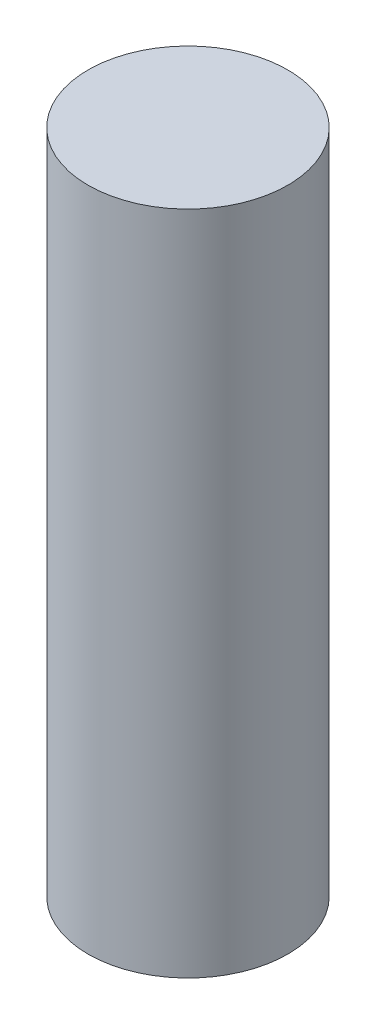
ISO-10303-21;
HEADER;
FILE_DESCRIPTION(('STEP AP214'),'2;1');
FILE_NAME('part.step','',(''),(''),'','','');
FILE_SCHEMA(('AUTOMOTIVE_DESIGN { 1 0 10303 214 1 1 1 1 }'));
ENDSEC;
DATA;
#1=APPLICATION_CONTEXT('core data for automotive mechanical design processes');
#2=APPLICATION_PROTOCOL_DEFINITION('international standard','automotive_design',2000,#1);
#3=PRODUCT_CONTEXT('',#1,'mechanical');
#4=PRODUCT('Part','Part','',(#3));
#5=PRODUCT_RELATED_PRODUCT_CATEGORY('part','',(#4));
#6=PRODUCT_DEFINITION_FORMATION('','',#4);
#7=PRODUCT_DEFINITION_CONTEXT('part definition',#1,'design');
#8=PRODUCT_DEFINITION('design','',#6,#7);
#9=PRODUCT_DEFINITION_SHAPE('','',#8);
#10=(LENGTH_UNIT() NAMED_UNIT(*) SI_UNIT(.MILLI.,.METRE.));
#11=(NAMED_UNIT(*) PLANE_ANGLE_UNIT() SI_UNIT($,.RADIAN.));
#12=(NAMED_UNIT(*) SI_UNIT($,.STERADIAN.) SOLID_ANGLE_UNIT());
#13=UNCERTAINTY_MEASURE_WITH_UNIT(LENGTH_MEASURE(1.E-05),#10,'distance_accuracy_value','');
#14=(GEOMETRIC_REPRESENTATION_CONTEXT(3) GLOBAL_UNCERTAINTY_ASSIGNED_CONTEXT((#13)) GLOBAL_UNIT_ASSIGNED_CONTEXT((#10,
#11,#12)) REPRESENTATION_CONTEXT('',''));
#15=CARTESIAN_POINT('',(0.,0.,0.));
#16=DIRECTION('',(0.,0.,1.));
#17=DIRECTION('',(1.,0.,0.));
#18=AXIS2_PLACEMENT_3D('',#15,#16,#17);
#19=CARTESIAN_POINT('',(0.,50.,0.));
#20=DIRECTION('',(0.,-1.,0.));
#21=DIRECTION('',(0.,0.,-1.));
#22=AXIS2_PLACEMENT_3D('',#19,#20,#21);
#23=CYLINDRICAL_SURFACE('',#22,7.5);
#24=CARTESIAN_POINT('',(0.,50.,0.));
#25=DIRECTION('',(0.,1.,0.));
#26=DIRECTION('',(0.,0.,1.));
#27=AXIS2_PLACEMENT_3D('',#24,#25,#26);
#28=CIRCLE('',#27,7.5);
#29=CARTESIAN_POINT('',(0.,50.,7.5));
#30=VERTEX_POINT('',#29);
#31=EDGE_CURVE('E10',#30,#30,#28,.T.);
#32=ORIENTED_EDGE('',*,*,#31,.F.);
#33=EDGE_LOOP('',(#32));
#34=FACE_BOUND('',#33,.T.);
#35=CARTESIAN_POINT('',(0.,0.,0.));
#36=DIRECTION('',(0.,1.,0.));
#37=DIRECTION('',(0.,0.,1.));
#38=AXIS2_PLACEMENT_3D('',#35,#36,#37);
#39=CIRCLE('',#38,7.5);
#40=CARTESIAN_POINT('',(0.,0.,7.5));
#41=VERTEX_POINT('',#40);
#42=EDGE_CURVE('E34',#41,#41,#39,.T.);
#43=ORIENTED_EDGE('',*,*,#42,.T.);
#44=EDGE_LOOP('',(#43));
#45=FACE_BOUND('',#44,.T.);
#46=ADVANCED_FACE('F31',(#34,#45),#23,.T.);
#47=CARTESIAN_POINT('',(0.,50.,0.));
#48=DIRECTION('',(0.,1.,0.));
#49=DIRECTION('',(0.,0.,1.));
#50=AXIS2_PLACEMENT_3D('',#47,#48,#49);
#51=PLANE('',#50);
#52=ORIENTED_EDGE('',*,*,#31,.T.);
#53=EDGE_LOOP('',(#52));
#54=FACE_BOUND('',#53,.T.);
#55=ADVANCED_FACE('F46',(#54),#51,.T.);
#56=CARTESIAN_POINT('',(0.,0.,0.));
#57=DIRECTION('',(0.,1.,0.));
#58=DIRECTION('',(0.,0.,1.));
#59=AXIS2_PLACEMENT_3D('',#56,#57,#58);
#60=PLANE('',#59);
#61=ORIENTED_EDGE('',*,*,#42,.F.);
#62=EDGE_LOOP('',(#61));
#63=FACE_BOUND('',#62,.T.);
#64=ADVANCED_FACE('F44',(#63),#60,.F.);
#65=CLOSED_SHELL('',(#46,#55,#64));
#66=MANIFOLD_SOLID_BREP('B2',#65);
#67=ADVANCED_BREP_SHAPE_REPRESENTATION('',(#18,#66),#14);
#68=SHAPE_DEFINITION_REPRESENTATION(#9,#67);
ENDSEC;
END-ISO-10303-21;
